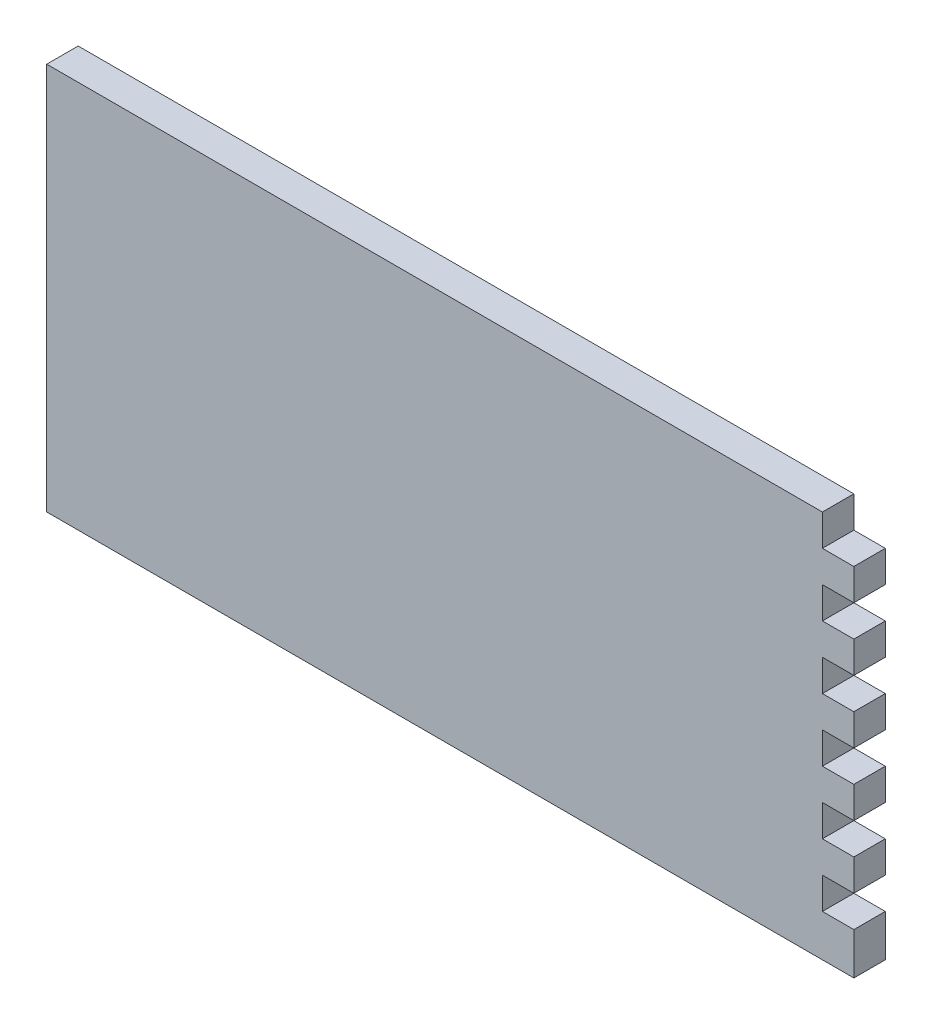
ISO-10303-21;
HEADER;
FILE_DESCRIPTION(('STEP AP214'),'2;1');
FILE_NAME('part.step','',(''),(''),'','','');
FILE_SCHEMA(('AUTOMOTIVE_DESIGN { 1 0 10303 214 1 1 1 1 }'));
ENDSEC;
DATA;
#1=APPLICATION_CONTEXT('core data for automotive mechanical design processes');
#2=APPLICATION_PROTOCOL_DEFINITION('international standard','automotive_design',2000,#1);
#3=PRODUCT_CONTEXT('',#1,'mechanical');
#4=PRODUCT('Part','Part','',(#3));
#5=PRODUCT_RELATED_PRODUCT_CATEGORY('part','',(#4));
#6=PRODUCT_DEFINITION_FORMATION('','',#4);
#7=PRODUCT_DEFINITION_CONTEXT('part definition',#1,'design');
#8=PRODUCT_DEFINITION('design','',#6,#7);
#9=PRODUCT_DEFINITION_SHAPE('','',#8);
#10=(LENGTH_UNIT() NAMED_UNIT(*) SI_UNIT(.MILLI.,.METRE.));
#11=(NAMED_UNIT(*) PLANE_ANGLE_UNIT() SI_UNIT($,.RADIAN.));
#12=(NAMED_UNIT(*) SI_UNIT($,.STERADIAN.) SOLID_ANGLE_UNIT());
#13=UNCERTAINTY_MEASURE_WITH_UNIT(LENGTH_MEASURE(1.E-05),#10,'distance_accuracy_value','');
#14=(GEOMETRIC_REPRESENTATION_CONTEXT(3) GLOBAL_UNCERTAINTY_ASSIGNED_CONTEXT((#13)) GLOBAL_UNIT_ASSIGNED_CONTEXT((#10,
#11,#12)) REPRESENTATION_CONTEXT('',''));
#15=CARTESIAN_POINT('',(0.,0.,0.));
#16=DIRECTION('',(0.,0.,1.));
#17=DIRECTION('',(1.,0.,0.));
#18=AXIS2_PLACEMENT_3D('',#15,#16,#17);
#19=CARTESIAN_POINT('',(0.,92.5,-7.49999999999998));
#20=DIRECTION('',(-1.,0.,0.));
#21=DIRECTION('',(0.,0.,1.));
#22=AXIS2_PLACEMENT_3D('',#19,#20,#21);
#23=PLANE('',#22);
#24=DIRECTION('',(0.,-1.,0.));
#25=VECTOR('',#24,1.);
#26=CARTESIAN_POINT('',(0.,92.5,-7.49999999999998));
#27=LINE('',#26,#25);
#28=CARTESIAN_POINT('',(0.,85.,-7.49999999999998));
#29=VERTEX_POINT('',#28);
#30=CARTESIAN_POINT('',(0.,77.5,-7.49999999999998));
#31=VERTEX_POINT('',#30);
#32=EDGE_CURVE('E45',#29,#31,#27,.T.);
#33=ORIENTED_EDGE('',*,*,#32,.F.);
#34=DIRECTION('',(0.,0.,1.));
#35=VECTOR('',#34,1.);
#36=CARTESIAN_POINT('',(0.,85.,-92.5));
#37=LINE('',#36,#35);
#38=CARTESIAN_POINT('',(0.,85.,0.));
#39=VERTEX_POINT('',#38);
#40=EDGE_CURVE('E221',#29,#39,#37,.T.);
#41=ORIENTED_EDGE('',*,*,#40,.T.);
#42=DIRECTION('',(0.,-1.,0.));
#43=VECTOR('',#42,1.);
#44=CARTESIAN_POINT('',(0.,92.5,0.));
#45=LINE('',#44,#43);
#46=CARTESIAN_POINT('',(0.,77.5,0.));
#47=VERTEX_POINT('',#46);
#48=EDGE_CURVE('E234',#39,#47,#45,.T.);
#49=ORIENTED_EDGE('',*,*,#48,.T.);
#50=DIRECTION('',(0.,0.,1.));
#51=VECTOR('',#50,1.);
#52=CARTESIAN_POINT('',(0.,77.5,-92.5));
#53=LINE('',#52,#51);
#54=EDGE_CURVE('E229',#31,#47,#53,.T.);
#55=ORIENTED_EDGE('',*,*,#54,.F.);
#56=EDGE_LOOP('',(#33,#41,#49,#55));
#57=FACE_BOUND('',#56,.T.);
#58=ADVANCED_FACE('F37',(#57),#23,.F.);
#59=CARTESIAN_POINT('',(0.,70.,-7.49999999999998));
#60=VERTEX_POINT('',#59);
#61=CARTESIAN_POINT('',(0.,62.5,-7.49999999999998));
#62=VERTEX_POINT('',#61);
#63=EDGE_CURVE('E398',#60,#62,#27,.T.);
#64=ORIENTED_EDGE('',*,*,#63,.F.);
#65=DIRECTION('',(0.,0.,1.));
#66=VECTOR('',#65,1.);
#67=CARTESIAN_POINT('',(0.,70.,-92.5));
#68=LINE('',#67,#66);
#69=CARTESIAN_POINT('',(0.,70.,0.));
#70=VERTEX_POINT('',#69);
#71=EDGE_CURVE('E248',#60,#70,#68,.T.);
#72=ORIENTED_EDGE('',*,*,#71,.T.);
#73=CARTESIAN_POINT('',(0.,62.5,0.));
#74=VERTEX_POINT('',#73);
#75=EDGE_CURVE('E471',#70,#74,#45,.T.);
#76=ORIENTED_EDGE('',*,*,#75,.T.);
#77=DIRECTION('',(0.,0.,1.));
#78=VECTOR('',#77,1.);
#79=CARTESIAN_POINT('',(0.,62.5,-92.5));
#80=LINE('',#79,#78);
#81=EDGE_CURVE('E241',#62,#74,#80,.T.);
#82=ORIENTED_EDGE('',*,*,#81,.F.);
#83=EDGE_LOOP('',(#64,#72,#76,#82));
#84=FACE_BOUND('',#83,.T.);
#85=ADVANCED_FACE('F469',(#84),#23,.F.);
#86=CARTESIAN_POINT('',(0.,40.,-7.49999999999998));
#87=VERTEX_POINT('',#86);
#88=CARTESIAN_POINT('',(0.,32.4999999999999,-7.49999999999998));
#89=VERTEX_POINT('',#88);
#90=EDGE_CURVE('E396',#87,#89,#27,.T.);
#91=ORIENTED_EDGE('',*,*,#90,.F.);
#92=DIRECTION('',(0.,0.,1.));
#93=VECTOR('',#92,1.);
#94=CARTESIAN_POINT('',(0.,40.,-92.5));
#95=LINE('',#94,#93);
#96=CARTESIAN_POINT('',(0.,40.,0.));
#97=VERTEX_POINT('',#96);
#98=EDGE_CURVE('E256',#87,#97,#95,.T.);
#99=ORIENTED_EDGE('',*,*,#98,.T.);
#100=CARTESIAN_POINT('',(0.,32.4999999999999,0.));
#101=VERTEX_POINT('',#100);
#102=EDGE_CURVE('E414',#97,#101,#45,.T.);
#103=ORIENTED_EDGE('',*,*,#102,.T.);
#104=DIRECTION('',(0.,0.,1.));
#105=VECTOR('',#104,1.);
#106=CARTESIAN_POINT('',(0.,32.4999999999999,-92.5));
#107=LINE('',#106,#105);
#108=EDGE_CURVE('E296',#89,#101,#107,.T.);
#109=ORIENTED_EDGE('',*,*,#108,.F.);
#110=EDGE_LOOP('',(#91,#99,#103,#109));
#111=FACE_BOUND('',#110,.T.);
#112=ADVANCED_FACE('F411',(#111),#23,.F.);
#113=CARTESIAN_POINT('',(0.,55.,-7.49999999999998));
#114=VERTEX_POINT('',#113);
#115=CARTESIAN_POINT('',(0.,47.5,-7.49999999999998));
#116=VERTEX_POINT('',#115);
#117=EDGE_CURVE('E401',#114,#116,#27,.T.);
#118=ORIENTED_EDGE('',*,*,#117,.F.);
#119=DIRECTION('',(0.,0.,1.));
#120=VECTOR('',#119,1.);
#121=CARTESIAN_POINT('',(0.,55.,-92.5));
#122=LINE('',#121,#120);
#123=CARTESIAN_POINT('',(0.,55.,0.));
#124=VERTEX_POINT('',#123);
#125=EDGE_CURVE('E263',#114,#124,#122,.T.);
#126=ORIENTED_EDGE('',*,*,#125,.T.);
#127=CARTESIAN_POINT('',(0.,47.5,0.));
#128=VERTEX_POINT('',#127);
#129=EDGE_CURVE('E484',#124,#128,#45,.T.);
#130=ORIENTED_EDGE('',*,*,#129,.T.);
#131=DIRECTION('',(0.,0.,1.));
#132=VECTOR('',#131,1.);
#133=CARTESIAN_POINT('',(0.,47.5,-92.5));
#134=LINE('',#133,#132);
#135=EDGE_CURVE('E278',#116,#128,#134,.T.);
#136=ORIENTED_EDGE('',*,*,#135,.F.);
#137=EDGE_LOOP('',(#118,#126,#130,#136));
#138=FACE_BOUND('',#137,.T.);
#139=ADVANCED_FACE('F482',(#138),#23,.F.);
#140=CARTESIAN_POINT('',(0.,24.9999999999999,-7.49999999999998));
#141=VERTEX_POINT('',#140);
#142=CARTESIAN_POINT('',(0.,17.4999999999999,-7.49999999999998));
#143=VERTEX_POINT('',#142);
#144=EDGE_CURVE('E391',#141,#143,#27,.T.);
#145=ORIENTED_EDGE('',*,*,#144,.F.);
#146=DIRECTION('',(0.,0.,1.));
#147=VECTOR('',#146,1.);
#148=CARTESIAN_POINT('',(0.,24.9999999999999,-92.5));
#149=LINE('',#148,#147);
#150=CARTESIAN_POINT('',(0.,24.9999999999999,0.));
#151=VERTEX_POINT('',#150);
#152=EDGE_CURVE('E298',#141,#151,#149,.T.);
#153=ORIENTED_EDGE('',*,*,#152,.T.);
#154=CARTESIAN_POINT('',(0.,17.4999999999999,0.));
#155=VERTEX_POINT('',#154);
#156=EDGE_CURVE('E384',#151,#155,#45,.T.);
#157=ORIENTED_EDGE('',*,*,#156,.T.);
#158=DIRECTION('',(0.,0.,1.));
#159=VECTOR('',#158,1.);
#160=CARTESIAN_POINT('',(0.,17.4999999999999,-92.5));
#161=LINE('',#160,#159);
#162=EDGE_CURVE('E289',#143,#155,#161,.T.);
#163=ORIENTED_EDGE('',*,*,#162,.F.);
#164=EDGE_LOOP('',(#145,#153,#157,#163));
#165=FACE_BOUND('',#164,.T.);
#166=ADVANCED_FACE('F431',(#165),#23,.F.);
#167=CARTESIAN_POINT('',(0.,9.99999999999993,-7.49999999999998));
#168=VERTEX_POINT('',#167);
#169=CARTESIAN_POINT('',(0.,0.,-7.49999999999998));
#170=VERTEX_POINT('',#169);
#171=EDGE_CURVE('E390',#168,#170,#27,.T.);
#172=ORIENTED_EDGE('',*,*,#171,.F.);
#173=DIRECTION('',(0.,0.,1.));
#174=VECTOR('',#173,1.);
#175=CARTESIAN_POINT('',(0.,9.99999999999993,-92.5));
#176=LINE('',#175,#174);
#177=CARTESIAN_POINT('',(0.,9.99999999999993,0.));
#178=VERTEX_POINT('',#177);
#179=EDGE_CURVE('E312',#168,#178,#176,.T.);
#180=ORIENTED_EDGE('',*,*,#179,.T.);
#181=CARTESIAN_POINT('',(0.,0.,0.));
#182=VERTEX_POINT('',#181);
#183=EDGE_CURVE('E374',#178,#182,#45,.T.);
#184=ORIENTED_EDGE('',*,*,#183,.T.);
#185=DIRECTION('',(0.,0.,-1.));
#186=VECTOR('',#185,1.);
#187=CARTESIAN_POINT('',(0.,0.,-7.49999999999998));
#188=LINE('',#187,#186);
#189=EDGE_CURVE('E366',#182,#170,#188,.T.);
#190=ORIENTED_EDGE('',*,*,#189,.T.);
#191=EDGE_LOOP('',(#172,#180,#184,#190));
#192=FACE_BOUND('',#191,.T.);
#193=ADVANCED_FACE('F39',(#192),#23,.F.);
#194=CARTESIAN_POINT('',(-192.5,92.5,-7.49999999999998));
#195=DIRECTION('',(0.,0.,1.));
#196=DIRECTION('',(1.,0.,0.));
#197=AXIS2_PLACEMENT_3D('',#194,#195,#196);
#198=PLANE('',#197);
#199=DIRECTION('',(-1.,0.,0.));
#200=VECTOR('',#199,1.);
#201=CARTESIAN_POINT('',(-192.5,92.5,-7.49999999999998));
#202=LINE('',#201,#200);
#203=CARTESIAN_POINT('',(-7.50000000000001,92.5,-7.49999999999998));
#204=VERTEX_POINT('',#203);
#205=CARTESIAN_POINT('',(-192.5,92.5,-7.49999999999998));
#206=VERTEX_POINT('',#205);
#207=EDGE_CURVE('E367',#204,#206,#202,.T.);
#208=ORIENTED_EDGE('',*,*,#207,.F.);
#209=DIRECTION('',(0.,-1.,0.));
#210=VECTOR('',#209,1.);
#211=CARTESIAN_POINT('',(-7.49999999999998,92.5,-7.49999999999998));
#212=LINE('',#211,#210);
#213=CARTESIAN_POINT('',(-7.5,85.,-7.49999999999998));
#214=VERTEX_POINT('',#213);
#215=EDGE_CURVE('E237',#204,#214,#212,.T.);
#216=ORIENTED_EDGE('',*,*,#215,.T.);
#217=DIRECTION('',(1.,0.,0.));
#218=VECTOR('',#217,1.);
#219=CARTESIAN_POINT('',(-192.5,85.,-7.49999999999998));
#220=LINE('',#219,#218);
#221=EDGE_CURVE('E218',#214,#29,#220,.T.);
#222=ORIENTED_EDGE('',*,*,#221,.T.);
#223=ORIENTED_EDGE('',*,*,#32,.T.);
#224=DIRECTION('',(-1.,0.,0.));
#225=VECTOR('',#224,1.);
#226=CARTESIAN_POINT('',(-192.5,77.5,-7.49999999999998));
#227=LINE('',#226,#225);
#228=CARTESIAN_POINT('',(-7.5,77.5,-7.49999999999998));
#229=VERTEX_POINT('',#228);
#230=EDGE_CURVE('E362',#31,#229,#227,.T.);
#231=ORIENTED_EDGE('',*,*,#230,.T.);
#232=DIRECTION('',(0.,-1.,0.));
#233=VECTOR('',#232,1.);
#234=CARTESIAN_POINT('',(-7.49999999999998,92.5,-7.49999999999998));
#235=LINE('',#234,#233);
#236=CARTESIAN_POINT('',(-7.5,70.,-7.49999999999998));
#237=VERTEX_POINT('',#236);
#238=EDGE_CURVE('E356',#229,#237,#235,.T.);
#239=ORIENTED_EDGE('',*,*,#238,.T.);
#240=DIRECTION('',(1.,0.,0.));
#241=VECTOR('',#240,1.);
#242=CARTESIAN_POINT('',(-192.5,70.,-7.49999999999998));
#243=LINE('',#242,#241);
#244=EDGE_CURVE('E359',#237,#60,#243,.T.);
#245=ORIENTED_EDGE('',*,*,#244,.T.);
#246=ORIENTED_EDGE('',*,*,#63,.T.);
#247=DIRECTION('',(-1.,0.,0.));
#248=VECTOR('',#247,1.);
#249=CARTESIAN_POINT('',(-192.5,62.5,-7.49999999999998));
#250=LINE('',#249,#248);
#251=CARTESIAN_POINT('',(-7.5,62.5,-7.49999999999998));
#252=VERTEX_POINT('',#251);
#253=EDGE_CURVE('E353',#62,#252,#250,.T.);
#254=ORIENTED_EDGE('',*,*,#253,.T.);
#255=DIRECTION('',(0.,-1.,0.));
#256=VECTOR('',#255,1.);
#257=CARTESIAN_POINT('',(-7.50000000000001,92.5,-7.49999999999998));
#258=LINE('',#257,#256);
#259=CARTESIAN_POINT('',(-7.5,55.,-7.49999999999998));
#260=VERTEX_POINT('',#259);
#261=EDGE_CURVE('E347',#252,#260,#258,.T.);
#262=ORIENTED_EDGE('',*,*,#261,.T.);
#263=DIRECTION('',(1.,0.,0.));
#264=VECTOR('',#263,1.);
#265=CARTESIAN_POINT('',(-192.5,55.,-7.49999999999998));
#266=LINE('',#265,#264);
#267=EDGE_CURVE('E350',#260,#114,#266,.T.);
#268=ORIENTED_EDGE('',*,*,#267,.T.);
#269=ORIENTED_EDGE('',*,*,#117,.T.);
#270=DIRECTION('',(-1.,0.,0.));
#271=VECTOR('',#270,1.);
#272=CARTESIAN_POINT('',(-192.5,47.5,-7.49999999999998));
#273=LINE('',#272,#271);
#274=CARTESIAN_POINT('',(-7.5,47.5,-7.49999999999998));
#275=VERTEX_POINT('',#274);
#276=EDGE_CURVE('E338',#116,#275,#273,.T.);
#277=ORIENTED_EDGE('',*,*,#276,.T.);
#278=DIRECTION('',(0.,-1.,0.));
#279=VECTOR('',#278,1.);
#280=CARTESIAN_POINT('',(-7.50000000000001,92.5,-7.49999999999998));
#281=LINE('',#280,#279);
#282=CARTESIAN_POINT('',(-7.5,40.,-7.49999999999998));
#283=VERTEX_POINT('',#282);
#284=EDGE_CURVE('E341',#275,#283,#281,.T.);
#285=ORIENTED_EDGE('',*,*,#284,.T.);
#286=DIRECTION('',(1.,0.,0.));
#287=VECTOR('',#286,1.);
#288=CARTESIAN_POINT('',(-192.5,40.,-7.49999999999998));
#289=LINE('',#288,#287);
#290=EDGE_CURVE('E344',#283,#87,#289,.T.);
#291=ORIENTED_EDGE('',*,*,#290,.T.);
#292=ORIENTED_EDGE('',*,*,#90,.T.);
#293=DIRECTION('',(-1.,0.,0.));
#294=VECTOR('',#293,1.);
#295=CARTESIAN_POINT('',(-192.5,32.4999999999999,-7.49999999999998));
#296=LINE('',#295,#294);
#297=CARTESIAN_POINT('',(-7.5,32.4999999999999,-7.49999999999998));
#298=VERTEX_POINT('',#297);
#299=EDGE_CURVE('E332',#89,#298,#296,.T.);
#300=ORIENTED_EDGE('',*,*,#299,.T.);
#301=DIRECTION('',(0.,-1.,0.));
#302=VECTOR('',#301,1.);
#303=CARTESIAN_POINT('',(-7.50000000000001,92.5,-7.49999999999998));
#304=LINE('',#303,#302);
#305=CARTESIAN_POINT('',(-7.5,24.9999999999999,-7.49999999999998));
#306=VERTEX_POINT('',#305);
#307=EDGE_CURVE('E335',#298,#306,#304,.T.);
#308=ORIENTED_EDGE('',*,*,#307,.T.);
#309=DIRECTION('',(1.,0.,0.));
#310=VECTOR('',#309,1.);
#311=CARTESIAN_POINT('',(-192.5,24.9999999999999,-7.49999999999998));
#312=LINE('',#311,#310);
#313=EDGE_CURVE('E329',#306,#141,#312,.T.);
#314=ORIENTED_EDGE('',*,*,#313,.T.);
#315=ORIENTED_EDGE('',*,*,#144,.T.);
#316=DIRECTION('',(-1.,0.,0.));
#317=VECTOR('',#316,1.);
#318=CARTESIAN_POINT('',(-192.5,17.4999999999999,-7.49999999999998));
#319=LINE('',#318,#317);
#320=CARTESIAN_POINT('',(-7.5,17.4999999999999,-7.49999999999998));
#321=VERTEX_POINT('',#320);
#322=EDGE_CURVE('E326',#143,#321,#319,.T.);
#323=ORIENTED_EDGE('',*,*,#322,.T.);
#324=DIRECTION('',(0.,-1.,0.));
#325=VECTOR('',#324,1.);
#326=CARTESIAN_POINT('',(-7.50000000000001,92.5,-7.49999999999998));
#327=LINE('',#326,#325);
#328=CARTESIAN_POINT('',(-7.5,9.99999999999993,-7.49999999999998));
#329=VERTEX_POINT('',#328);
#330=EDGE_CURVE('E320',#321,#329,#327,.T.);
#331=ORIENTED_EDGE('',*,*,#330,.T.);
#332=DIRECTION('',(1.,0.,0.));
#333=VECTOR('',#332,1.);
#334=CARTESIAN_POINT('',(-192.5,9.99999999999993,-7.49999999999998));
#335=LINE('',#334,#333);
#336=EDGE_CURVE('E323',#329,#168,#335,.T.);
#337=ORIENTED_EDGE('',*,*,#336,.T.);
#338=ORIENTED_EDGE('',*,*,#171,.T.);
#339=DIRECTION('',(-1.,0.,0.));
#340=VECTOR('',#339,1.);
#341=CARTESIAN_POINT('',(-192.5,0.,-7.49999999999998));
#342=LINE('',#341,#340);
#343=CARTESIAN_POINT('',(-192.5,0.,-7.49999999999998));
#344=VERTEX_POINT('',#343);
#345=EDGE_CURVE('E377',#170,#344,#342,.T.);
#346=ORIENTED_EDGE('',*,*,#345,.T.);
#347=DIRECTION('',(0.,-1.,0.));
#348=VECTOR('',#347,1.);
#349=CARTESIAN_POINT('',(-192.5,92.5,-7.49999999999998));
#350=LINE('',#349,#348);
#351=EDGE_CURVE('E388',#206,#344,#350,.T.);
#352=ORIENTED_EDGE('',*,*,#351,.F.);
#353=EDGE_LOOP('',(#208,#216,#222,#223,#231,#239,#245,#246,#254,#262,#268,#269,#277,#285,#291,
#292,#300,#308,#314,#315,#323,#331,#337,#338,#346,#352));
#354=FACE_BOUND('',#353,.T.);
#355=ADVANCED_FACE('F408',(#354),#198,.F.);
#356=CARTESIAN_POINT('',(-192.5,92.5,0.));
#357=DIRECTION('',(1.,0.,0.));
#358=DIRECTION('',(0.,0.,-1.));
#359=AXIS2_PLACEMENT_3D('',#356,#357,#358);
#360=PLANE('',#359);
#361=DIRECTION('',(0.,0.,1.));
#362=VECTOR('',#361,1.);
#363=CARTESIAN_POINT('',(-192.5,0.,0.));
#364=LINE('',#363,#362);
#365=CARTESIAN_POINT('',(-192.5,0.,0.));
#366=VERTEX_POINT('',#365);
#367=EDGE_CURVE('E379',#344,#366,#364,.T.);
#368=ORIENTED_EDGE('',*,*,#367,.T.);
#369=DIRECTION('',(0.,-1.,0.));
#370=VECTOR('',#369,1.);
#371=CARTESIAN_POINT('',(-192.5,92.5,0.));
#372=LINE('',#371,#370);
#373=CARTESIAN_POINT('',(-192.5,92.5,0.));
#374=VERTEX_POINT('',#373);
#375=EDGE_CURVE('E385',#374,#366,#372,.T.);
#376=ORIENTED_EDGE('',*,*,#375,.F.);
#377=DIRECTION('',(0.,0.,1.));
#378=VECTOR('',#377,1.);
#379=CARTESIAN_POINT('',(-192.5,92.5,0.));
#380=LINE('',#379,#378);
#381=EDGE_CURVE('E369',#206,#374,#380,.T.);
#382=ORIENTED_EDGE('',*,*,#381,.F.);
#383=ORIENTED_EDGE('',*,*,#351,.T.);
#384=EDGE_LOOP('',(#368,#376,#382,#383));
#385=FACE_BOUND('',#384,.T.);
#386=ADVANCED_FACE('F453',(#385),#360,.F.);
#387=CARTESIAN_POINT('',(0.,92.5,0.));
#388=DIRECTION('',(0.,0.,-1.));
#389=DIRECTION('',(-1.,0.,0.));
#390=AXIS2_PLACEMENT_3D('',#387,#388,#389);
#391=PLANE('',#390);
#392=DIRECTION('',(1.,0.,0.));
#393=VECTOR('',#392,1.);
#394=CARTESIAN_POINT('',(0.,85.,0.));
#395=LINE('',#394,#393);
#396=CARTESIAN_POINT('',(-7.5,85.,0.));
#397=VERTEX_POINT('',#396);
#398=EDGE_CURVE('E215',#397,#39,#395,.T.);
#399=ORIENTED_EDGE('',*,*,#398,.F.);
#400=DIRECTION('',(0.,-1.,0.));
#401=VECTOR('',#400,1.);
#402=CARTESIAN_POINT('',(-7.49999999999999,0.,0.));
#403=LINE('',#402,#401);
#404=CARTESIAN_POINT('',(-7.5,92.5,0.));
#405=VERTEX_POINT('',#404);
#406=EDGE_CURVE('E224',#405,#397,#403,.T.);
#407=ORIENTED_EDGE('',*,*,#406,.F.);
#408=DIRECTION('',(1.,0.,0.));
#409=VECTOR('',#408,1.);
#410=CARTESIAN_POINT('',(0.,92.5,0.));
#411=LINE('',#410,#409);
#412=EDGE_CURVE('E372',#374,#405,#411,.T.);
#413=ORIENTED_EDGE('',*,*,#412,.F.);
#414=ORIENTED_EDGE('',*,*,#375,.T.);
#415=DIRECTION('',(1.,0.,0.));
#416=VECTOR('',#415,1.);
#417=CARTESIAN_POINT('',(0.,0.,0.));
#418=LINE('',#417,#416);
#419=EDGE_CURVE('E370',#366,#182,#418,.T.);
#420=ORIENTED_EDGE('',*,*,#419,.T.);
#421=ORIENTED_EDGE('',*,*,#183,.F.);
#422=DIRECTION('',(1.,0.,0.));
#423=VECTOR('',#422,1.);
#424=CARTESIAN_POINT('',(0.,9.99999999999993,0.));
#425=LINE('',#424,#423);
#426=CARTESIAN_POINT('',(-7.5,9.99999999999993,0.));
#427=VERTEX_POINT('',#426);
#428=EDGE_CURVE('E308',#427,#178,#425,.T.);
#429=ORIENTED_EDGE('',*,*,#428,.F.);
#430=DIRECTION('',(0.,-1.,0.));
#431=VECTOR('',#430,1.);
#432=CARTESIAN_POINT('',(-7.5,0.,0.));
#433=LINE('',#432,#431);
#434=CARTESIAN_POINT('',(-7.5,17.4999999999999,0.));
#435=VERTEX_POINT('',#434);
#436=EDGE_CURVE('E305',#435,#427,#433,.T.);
#437=ORIENTED_EDGE('',*,*,#436,.F.);
#438=DIRECTION('',(-1.,0.,0.));
#439=VECTOR('',#438,1.);
#440=CARTESIAN_POINT('',(0.,17.4999999999999,0.));
#441=LINE('',#440,#439);
#442=EDGE_CURVE('E303',#155,#435,#441,.T.);
#443=ORIENTED_EDGE('',*,*,#442,.F.);
#444=ORIENTED_EDGE('',*,*,#156,.F.);
#445=DIRECTION('',(1.,0.,0.));
#446=VECTOR('',#445,1.);
#447=CARTESIAN_POINT('',(0.,24.9999999999999,0.));
#448=LINE('',#447,#446);
#449=CARTESIAN_POINT('',(-7.5,24.9999999999999,0.));
#450=VERTEX_POINT('',#449);
#451=EDGE_CURVE('E288',#450,#151,#448,.T.);
#452=ORIENTED_EDGE('',*,*,#451,.F.);
#453=DIRECTION('',(0.,-1.,0.));
#454=VECTOR('',#453,1.);
#455=CARTESIAN_POINT('',(-7.5,0.,0.));
#456=LINE('',#455,#454);
#457=CARTESIAN_POINT('',(-7.5,32.4999999999999,0.));
#458=VERTEX_POINT('',#457);
#459=EDGE_CURVE('E286',#458,#450,#456,.T.);
#460=ORIENTED_EDGE('',*,*,#459,.F.);
#461=DIRECTION('',(-1.,0.,0.));
#462=VECTOR('',#461,1.);
#463=CARTESIAN_POINT('',(0.,32.4999999999999,0.));
#464=LINE('',#463,#462);
#465=EDGE_CURVE('E291',#101,#458,#464,.T.);
#466=ORIENTED_EDGE('',*,*,#465,.F.);
#467=ORIENTED_EDGE('',*,*,#102,.F.);
#468=DIRECTION('',(1.,0.,0.));
#469=VECTOR('',#468,1.);
#470=CARTESIAN_POINT('',(0.,40.,0.));
#471=LINE('',#470,#469);
#472=CARTESIAN_POINT('',(-7.5,40.,0.));
#473=VERTEX_POINT('',#472);
#474=EDGE_CURVE('E276',#473,#97,#471,.T.);
#475=ORIENTED_EDGE('',*,*,#474,.F.);
#476=DIRECTION('',(0.,-1.,0.));
#477=VECTOR('',#476,1.);
#478=CARTESIAN_POINT('',(-7.49999999999999,0.,0.));
#479=LINE('',#478,#477);
#480=CARTESIAN_POINT('',(-7.5,47.5,0.));
#481=VERTEX_POINT('',#480);
#482=EDGE_CURVE('E272',#481,#473,#479,.T.);
#483=ORIENTED_EDGE('',*,*,#482,.F.);
#484=DIRECTION('',(-1.,0.,0.));
#485=VECTOR('',#484,1.);
#486=CARTESIAN_POINT('',(0.,47.5,0.));
#487=LINE('',#486,#485);
#488=EDGE_CURVE('E269',#128,#481,#487,.T.);
#489=ORIENTED_EDGE('',*,*,#488,.F.);
#490=ORIENTED_EDGE('',*,*,#129,.F.);
#491=DIRECTION('',(1.,0.,0.));
#492=VECTOR('',#491,1.);
#493=CARTESIAN_POINT('',(0.,55.,0.));
#494=LINE('',#493,#492);
#495=CARTESIAN_POINT('',(-7.5,55.,0.));
#496=VERTEX_POINT('',#495);
#497=EDGE_CURVE('E259',#496,#124,#494,.T.);
#498=ORIENTED_EDGE('',*,*,#497,.F.);
#499=DIRECTION('',(0.,-1.,0.));
#500=VECTOR('',#499,1.);
#501=CARTESIAN_POINT('',(-7.49999999999999,0.,0.));
#502=LINE('',#501,#500);
#503=CARTESIAN_POINT('',(-7.5,62.5,0.));
#504=VERTEX_POINT('',#503);
#505=EDGE_CURVE('E255',#504,#496,#502,.T.);
#506=ORIENTED_EDGE('',*,*,#505,.F.);
#507=DIRECTION('',(-1.,0.,0.));
#508=VECTOR('',#507,1.);
#509=CARTESIAN_POINT('',(0.,62.5,0.));
#510=LINE('',#509,#508);
#511=EDGE_CURVE('E60',#74,#504,#510,.T.);
#512=ORIENTED_EDGE('',*,*,#511,.F.);
#513=ORIENTED_EDGE('',*,*,#75,.F.);
#514=DIRECTION('',(1.,0.,0.));
#515=VECTOR('',#514,1.);
#516=CARTESIAN_POINT('',(0.,70.,0.));
#517=LINE('',#516,#515);
#518=CARTESIAN_POINT('',(-7.5,70.,0.));
#519=VERTEX_POINT('',#518);
#520=EDGE_CURVE('E244',#519,#70,#517,.T.);
#521=ORIENTED_EDGE('',*,*,#520,.F.);
#522=DIRECTION('',(0.,-1.,0.));
#523=VECTOR('',#522,1.);
#524=CARTESIAN_POINT('',(-7.49999999999999,0.,0.));
#525=LINE('',#524,#523);
#526=CARTESIAN_POINT('',(-7.5,77.5,0.));
#527=VERTEX_POINT('',#526);
#528=EDGE_CURVE('E240',#527,#519,#525,.T.);
#529=ORIENTED_EDGE('',*,*,#528,.F.);
#530=DIRECTION('',(-1.,0.,0.));
#531=VECTOR('',#530,1.);
#532=CARTESIAN_POINT('',(0.,77.5,0.));
#533=LINE('',#532,#531);
#534=EDGE_CURVE('E52',#47,#527,#533,.T.);
#535=ORIENTED_EDGE('',*,*,#534,.F.);
#536=ORIENTED_EDGE('',*,*,#48,.F.);
#537=EDGE_LOOP('',(#399,#407,#413,#414,#420,#421,#429,#437,#443,#444,#452,#460,#466,#467,#475,
#483,#489,#490,#498,#506,#512,#513,#521,#529,#535,#536));
#538=FACE_BOUND('',#537,.T.);
#539=ADVANCED_FACE('F232',(#538),#391,.F.);
#540=CARTESIAN_POINT('',(0.,92.5,0.));
#541=DIRECTION('',(0.,-1.,0.));
#542=DIRECTION('',(0.,0.,-1.));
#543=AXIS2_PLACEMENT_3D('',#540,#541,#542);
#544=PLANE('',#543);
#545=ORIENTED_EDGE('',*,*,#412,.T.);
#546=DIRECTION('',(0.,0.,-1.));
#547=VECTOR('',#546,1.);
#548=CARTESIAN_POINT('',(-7.5,92.5,0.));
#549=LINE('',#548,#547);
#550=EDGE_CURVE('E11',#405,#204,#549,.T.);
#551=ORIENTED_EDGE('',*,*,#550,.T.);
#552=ORIENTED_EDGE('',*,*,#207,.T.);
#553=ORIENTED_EDGE('',*,*,#381,.T.);
#554=EDGE_LOOP('',(#545,#551,#552,#553));
#555=FACE_BOUND('',#554,.T.);
#556=ADVANCED_FACE('F456',(#555),#544,.F.);
#557=CARTESIAN_POINT('',(0.,0.,0.));
#558=DIRECTION('',(0.,-1.,0.));
#559=DIRECTION('',(0.,0.,-1.));
#560=AXIS2_PLACEMENT_3D('',#557,#558,#559);
#561=PLANE('',#560);
#562=ORIENTED_EDGE('',*,*,#189,.F.);
#563=ORIENTED_EDGE('',*,*,#419,.F.);
#564=ORIENTED_EDGE('',*,*,#367,.F.);
#565=ORIENTED_EDGE('',*,*,#345,.F.);
#566=EDGE_LOOP('',(#562,#563,#564,#565));
#567=FACE_BOUND('',#566,.T.);
#568=ADVANCED_FACE('F448',(#567),#561,.T.);
#569=CARTESIAN_POINT('',(0.,85.,-92.5));
#570=DIRECTION('',(0.,-1.,0.));
#571=DIRECTION('',(0.,0.,-1.));
#572=AXIS2_PLACEMENT_3D('',#569,#570,#571);
#573=PLANE('',#572);
#574=DIRECTION('',(0.,0.,1.));
#575=VECTOR('',#574,1.);
#576=CARTESIAN_POINT('',(-7.5,85.,-92.5));
#577=LINE('',#576,#575);
#578=EDGE_CURVE('E211',#214,#397,#577,.T.);
#579=ORIENTED_EDGE('',*,*,#578,.T.);
#580=ORIENTED_EDGE('',*,*,#398,.T.);
#581=ORIENTED_EDGE('',*,*,#40,.F.);
#582=ORIENTED_EDGE('',*,*,#221,.F.);
#583=EDGE_LOOP('',(#579,#580,#581,#582));
#584=FACE_BOUND('',#583,.T.);
#585=ADVANCED_FACE('F213',(#584),#573,.F.);
#586=CARTESIAN_POINT('',(-7.49999999999999,0.,-92.5));
#587=DIRECTION('',(-1.,0.,0.));
#588=DIRECTION('',(0.,-1.,0.));
#589=AXIS2_PLACEMENT_3D('',#586,#587,#588);
#590=PLANE('',#589);
#591=ORIENTED_EDGE('',*,*,#550,.F.);
#592=ORIENTED_EDGE('',*,*,#406,.T.);
#593=ORIENTED_EDGE('',*,*,#578,.F.);
#594=ORIENTED_EDGE('',*,*,#215,.F.);
#595=EDGE_LOOP('',(#591,#592,#593,#594));
#596=FACE_BOUND('',#595,.T.);
#597=ADVANCED_FACE('F225',(#596),#590,.F.);
#598=CARTESIAN_POINT('',(0.,17.4999999999999,-92.5));
#599=DIRECTION('',(0.,1.,0.));
#600=DIRECTION('',(0.,0.,1.));
#601=AXIS2_PLACEMENT_3D('',#598,#599,#600);
#602=PLANE('',#601);
#603=ORIENTED_EDGE('',*,*,#162,.T.);
#604=ORIENTED_EDGE('',*,*,#442,.T.);
#605=DIRECTION('',(0.,0.,1.));
#606=VECTOR('',#605,1.);
#607=CARTESIAN_POINT('',(-7.5,17.4999999999999,-92.5));
#608=LINE('',#607,#606);
#609=EDGE_CURVE('E310',#321,#435,#608,.T.);
#610=ORIENTED_EDGE('',*,*,#609,.F.);
#611=ORIENTED_EDGE('',*,*,#322,.F.);
#612=EDGE_LOOP('',(#603,#604,#610,#611));
#613=FACE_BOUND('',#612,.T.);
#614=ADVANCED_FACE('F435',(#613),#602,.F.);
#615=CARTESIAN_POINT('',(0.,9.99999999999993,-92.5));
#616=DIRECTION('',(0.,-1.,0.));
#617=DIRECTION('',(0.,0.,-1.));
#618=AXIS2_PLACEMENT_3D('',#615,#616,#617);
#619=PLANE('',#618);
#620=DIRECTION('',(0.,0.,1.));
#621=VECTOR('',#620,1.);
#622=CARTESIAN_POINT('',(-7.5,9.99999999999993,-92.5));
#623=LINE('',#622,#621);
#624=EDGE_CURVE('E315',#329,#427,#623,.T.);
#625=ORIENTED_EDGE('',*,*,#624,.T.);
#626=ORIENTED_EDGE('',*,*,#428,.T.);
#627=ORIENTED_EDGE('',*,*,#179,.F.);
#628=ORIENTED_EDGE('',*,*,#336,.F.);
#629=EDGE_LOOP('',(#625,#626,#627,#628));
#630=FACE_BOUND('',#629,.T.);
#631=ADVANCED_FACE('F594',(#630),#619,.F.);
#632=CARTESIAN_POINT('',(-7.5,0.,-92.5));
#633=DIRECTION('',(-1.,0.,0.));
#634=DIRECTION('',(0.,-1.,0.));
#635=AXIS2_PLACEMENT_3D('',#632,#633,#634);
#636=PLANE('',#635);
#637=ORIENTED_EDGE('',*,*,#609,.T.);
#638=ORIENTED_EDGE('',*,*,#436,.T.);
#639=ORIENTED_EDGE('',*,*,#624,.F.);
#640=ORIENTED_EDGE('',*,*,#330,.F.);
#641=EDGE_LOOP('',(#637,#638,#639,#640));
#642=FACE_BOUND('',#641,.T.);
#643=ADVANCED_FACE('F442',(#642),#636,.F.);
#644=CARTESIAN_POINT('',(-7.5,0.,-92.5));
#645=DIRECTION('',(-1.,0.,0.));
#646=DIRECTION('',(0.,-1.,0.));
#647=AXIS2_PLACEMENT_3D('',#644,#645,#646);
#648=PLANE('',#647);
#649=DIRECTION('',(0.,0.,1.));
#650=VECTOR('',#649,1.);
#651=CARTESIAN_POINT('',(-7.5,32.4999999999999,-92.5));
#652=LINE('',#651,#650);
#653=EDGE_CURVE('E273',#298,#458,#652,.T.);
#654=ORIENTED_EDGE('',*,*,#653,.T.);
#655=ORIENTED_EDGE('',*,*,#459,.T.);
#656=DIRECTION('',(0.,0.,1.));
#657=VECTOR('',#656,1.);
#658=CARTESIAN_POINT('',(-7.5,24.9999999999999,-92.5));
#659=LINE('',#658,#657);
#660=EDGE_CURVE('E294',#306,#450,#659,.T.);
#661=ORIENTED_EDGE('',*,*,#660,.F.);
#662=ORIENTED_EDGE('',*,*,#307,.F.);
#663=EDGE_LOOP('',(#654,#655,#661,#662));
#664=FACE_BOUND('',#663,.T.);
#665=ADVANCED_FACE('F425',(#664),#648,.F.);
#666=CARTESIAN_POINT('',(0.,32.4999999999999,-92.5));
#667=DIRECTION('',(0.,1.,0.));
#668=DIRECTION('',(0.,0.,1.));
#669=AXIS2_PLACEMENT_3D('',#666,#667,#668);
#670=PLANE('',#669);
#671=ORIENTED_EDGE('',*,*,#108,.T.);
#672=ORIENTED_EDGE('',*,*,#465,.T.);
#673=ORIENTED_EDGE('',*,*,#653,.F.);
#674=ORIENTED_EDGE('',*,*,#299,.F.);
#675=EDGE_LOOP('',(#671,#672,#673,#674));
#676=FACE_BOUND('',#675,.T.);
#677=ADVANCED_FACE('F417',(#676),#670,.F.);
#678=CARTESIAN_POINT('',(0.,24.9999999999999,-92.5));
#679=DIRECTION('',(0.,-1.,0.));
#680=DIRECTION('',(0.,0.,-1.));
#681=AXIS2_PLACEMENT_3D('',#678,#679,#680);
#682=PLANE('',#681);
#683=ORIENTED_EDGE('',*,*,#660,.T.);
#684=ORIENTED_EDGE('',*,*,#451,.T.);
#685=ORIENTED_EDGE('',*,*,#152,.F.);
#686=ORIENTED_EDGE('',*,*,#313,.F.);
#687=EDGE_LOOP('',(#683,#684,#685,#686));
#688=FACE_BOUND('',#687,.T.);
#689=ADVANCED_FACE('F427',(#688),#682,.F.);
#690=CARTESIAN_POINT('',(0.,40.,-92.5));
#691=DIRECTION('',(0.,-1.,0.));
#692=DIRECTION('',(0.,0.,-1.));
#693=AXIS2_PLACEMENT_3D('',#690,#691,#692);
#694=PLANE('',#693);
#695=DIRECTION('',(0.,0.,1.));
#696=VECTOR('',#695,1.);
#697=CARTESIAN_POINT('',(-7.5,40.,-92.5));
#698=LINE('',#697,#696);
#699=EDGE_CURVE('E281',#283,#473,#698,.T.);
#700=ORIENTED_EDGE('',*,*,#699,.T.);
#701=ORIENTED_EDGE('',*,*,#474,.T.);
#702=ORIENTED_EDGE('',*,*,#98,.F.);
#703=ORIENTED_EDGE('',*,*,#290,.F.);
#704=EDGE_LOOP('',(#700,#701,#702,#703));
#705=FACE_BOUND('',#704,.T.);
#706=ADVANCED_FACE('F494',(#705),#694,.F.);
#707=CARTESIAN_POINT('',(-7.49999999999999,0.,-92.5));
#708=DIRECTION('',(-1.,0.,0.));
#709=DIRECTION('',(0.,-1.,0.));
#710=AXIS2_PLACEMENT_3D('',#707,#708,#709);
#711=PLANE('',#710);
#712=DIRECTION('',(0.,0.,1.));
#713=VECTOR('',#712,1.);
#714=CARTESIAN_POINT('',(-7.5,47.5,-92.5));
#715=LINE('',#714,#713);
#716=EDGE_CURVE('E283',#275,#481,#715,.T.);
#717=ORIENTED_EDGE('',*,*,#716,.T.);
#718=ORIENTED_EDGE('',*,*,#482,.T.);
#719=ORIENTED_EDGE('',*,*,#699,.F.);
#720=ORIENTED_EDGE('',*,*,#284,.F.);
#721=EDGE_LOOP('',(#717,#718,#719,#720));
#722=FACE_BOUND('',#721,.T.);
#723=ADVANCED_FACE('F492',(#722),#711,.F.);
#724=CARTESIAN_POINT('',(0.,47.5,-92.5));
#725=DIRECTION('',(0.,1.,0.));
#726=DIRECTION('',(0.,0.,1.));
#727=AXIS2_PLACEMENT_3D('',#724,#725,#726);
#728=PLANE('',#727);
#729=ORIENTED_EDGE('',*,*,#135,.T.);
#730=ORIENTED_EDGE('',*,*,#488,.T.);
#731=ORIENTED_EDGE('',*,*,#716,.F.);
#732=ORIENTED_EDGE('',*,*,#276,.F.);
#733=EDGE_LOOP('',(#729,#730,#731,#732));
#734=FACE_BOUND('',#733,.T.);
#735=ADVANCED_FACE('F487',(#734),#728,.F.);
#736=CARTESIAN_POINT('',(0.,62.5,-92.5));
#737=DIRECTION('',(0.,1.,0.));
#738=DIRECTION('',(0.,0.,1.));
#739=AXIS2_PLACEMENT_3D('',#736,#737,#738);
#740=PLANE('',#739);
#741=ORIENTED_EDGE('',*,*,#81,.T.);
#742=ORIENTED_EDGE('',*,*,#511,.T.);
#743=DIRECTION('',(0.,0.,1.));
#744=VECTOR('',#743,1.);
#745=CARTESIAN_POINT('',(-7.5,62.5,-92.5));
#746=LINE('',#745,#744);
#747=EDGE_CURVE('E261',#252,#504,#746,.T.);
#748=ORIENTED_EDGE('',*,*,#747,.F.);
#749=ORIENTED_EDGE('',*,*,#253,.F.);
#750=EDGE_LOOP('',(#741,#742,#748,#749));
#751=FACE_BOUND('',#750,.T.);
#752=ADVANCED_FACE('F472',(#751),#740,.F.);
#753=CARTESIAN_POINT('',(0.,55.,-92.5));
#754=DIRECTION('',(0.,-1.,0.));
#755=DIRECTION('',(0.,0.,-1.));
#756=AXIS2_PLACEMENT_3D('',#753,#754,#755);
#757=PLANE('',#756);
#758=DIRECTION('',(0.,0.,1.));
#759=VECTOR('',#758,1.);
#760=CARTESIAN_POINT('',(-7.5,55.,-92.5));
#761=LINE('',#760,#759);
#762=EDGE_CURVE('E266',#260,#496,#761,.T.);
#763=ORIENTED_EDGE('',*,*,#762,.T.);
#764=ORIENTED_EDGE('',*,*,#497,.T.);
#765=ORIENTED_EDGE('',*,*,#125,.F.);
#766=ORIENTED_EDGE('',*,*,#267,.F.);
#767=EDGE_LOOP('',(#763,#764,#765,#766));
#768=FACE_BOUND('',#767,.T.);
#769=ADVANCED_FACE('F668',(#768),#757,.F.);
#770=CARTESIAN_POINT('',(-7.49999999999999,0.,-92.5));
#771=DIRECTION('',(-1.,0.,0.));
#772=DIRECTION('',(0.,-1.,0.));
#773=AXIS2_PLACEMENT_3D('',#770,#771,#772);
#774=PLANE('',#773);
#775=ORIENTED_EDGE('',*,*,#747,.T.);
#776=ORIENTED_EDGE('',*,*,#505,.T.);
#777=ORIENTED_EDGE('',*,*,#762,.F.);
#778=ORIENTED_EDGE('',*,*,#261,.F.);
#779=EDGE_LOOP('',(#775,#776,#777,#778));
#780=FACE_BOUND('',#779,.T.);
#781=ADVANCED_FACE('F478',(#780),#774,.F.);
#782=CARTESIAN_POINT('',(0.,77.5,-92.5));
#783=DIRECTION('',(0.,1.,0.));
#784=DIRECTION('',(0.,0.,1.));
#785=AXIS2_PLACEMENT_3D('',#782,#783,#784);
#786=PLANE('',#785);
#787=ORIENTED_EDGE('',*,*,#54,.T.);
#788=ORIENTED_EDGE('',*,*,#534,.T.);
#789=DIRECTION('',(0.,0.,1.));
#790=VECTOR('',#789,1.);
#791=CARTESIAN_POINT('',(-7.5,77.5,-92.5));
#792=LINE('',#791,#790);
#793=EDGE_CURVE('E246',#229,#527,#792,.T.);
#794=ORIENTED_EDGE('',*,*,#793,.F.);
#795=ORIENTED_EDGE('',*,*,#230,.F.);
#796=EDGE_LOOP('',(#787,#788,#794,#795));
#797=FACE_BOUND('',#796,.T.);
#798=ADVANCED_FACE('F459',(#797),#786,.F.);
#799=CARTESIAN_POINT('',(0.,70.,-92.5));
#800=DIRECTION('',(0.,-1.,0.));
#801=DIRECTION('',(0.,0.,-1.));
#802=AXIS2_PLACEMENT_3D('',#799,#800,#801);
#803=PLANE('',#802);
#804=DIRECTION('',(0.,0.,1.));
#805=VECTOR('',#804,1.);
#806=CARTESIAN_POINT('',(-7.5,70.,-92.5));
#807=LINE('',#806,#805);
#808=EDGE_CURVE('E251',#237,#519,#807,.T.);
#809=ORIENTED_EDGE('',*,*,#808,.T.);
#810=ORIENTED_EDGE('',*,*,#520,.T.);
#811=ORIENTED_EDGE('',*,*,#71,.F.);
#812=ORIENTED_EDGE('',*,*,#244,.F.);
#813=EDGE_LOOP('',(#809,#810,#811,#812));
#814=FACE_BOUND('',#813,.T.);
#815=ADVANCED_FACE('F695',(#814),#803,.F.);
#816=CARTESIAN_POINT('',(-7.49999999999999,0.,-92.5));
#817=DIRECTION('',(-1.,0.,0.));
#818=DIRECTION('',(0.,-1.,0.));
#819=AXIS2_PLACEMENT_3D('',#816,#817,#818);
#820=PLANE('',#819);
#821=ORIENTED_EDGE('',*,*,#793,.T.);
#822=ORIENTED_EDGE('',*,*,#528,.T.);
#823=ORIENTED_EDGE('',*,*,#808,.F.);
#824=ORIENTED_EDGE('',*,*,#238,.F.);
#825=EDGE_LOOP('',(#821,#822,#823,#824));
#826=FACE_BOUND('',#825,.T.);
#827=ADVANCED_FACE('F465',(#826),#820,.F.);
#828=CLOSED_SHELL('',(#58,#85,#112,#139,#166,#193,#355,#386,#539,#556,#568,#585,#597,#614,#631,
#643,#665,#677,#689,#706,#723,#735,#752,#769,#781,#798,#815,#827));
#829=MANIFOLD_SOLID_BREP('B2',#828);
#830=ADVANCED_BREP_SHAPE_REPRESENTATION('',(#18,#829),#14);
#831=SHAPE_DEFINITION_REPRESENTATION(#9,#830);
ENDSEC;
END-ISO-10303-21;
